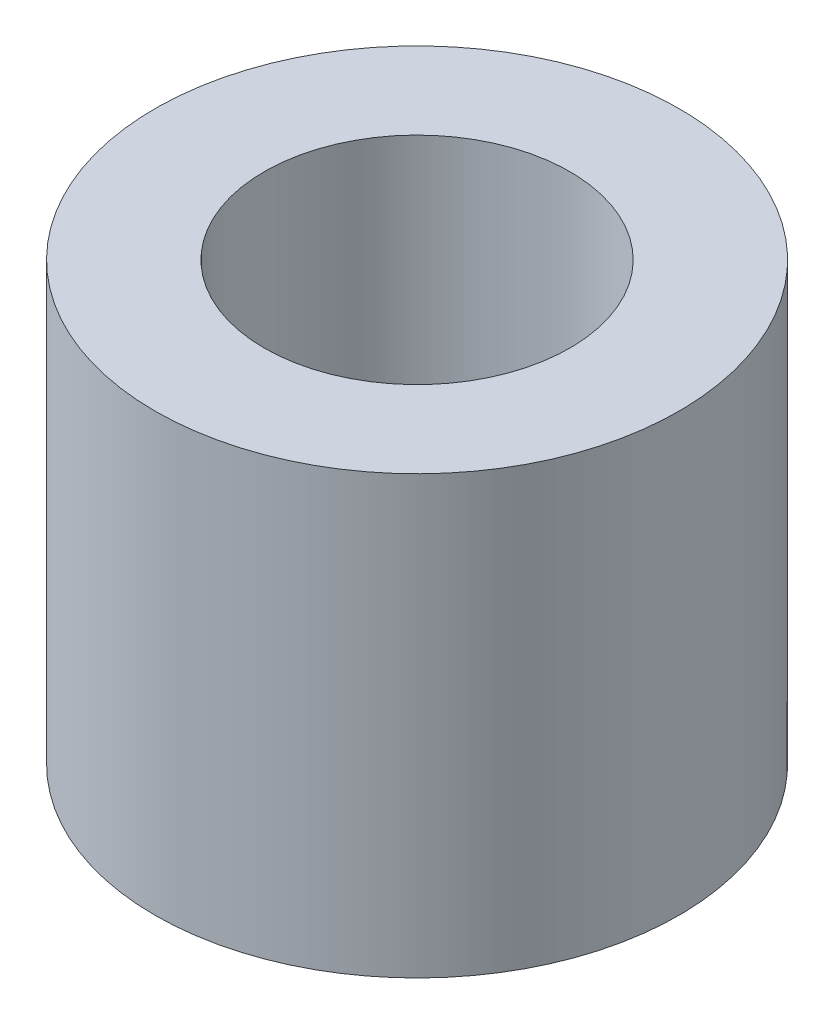
ISO-10303-21;
HEADER;
FILE_DESCRIPTION(('STEP AP214'),'2;1');
FILE_NAME('part.step','',(''),(''),'','','');
FILE_SCHEMA(('AUTOMOTIVE_DESIGN { 1 0 10303 214 1 1 1 1 }'));
ENDSEC;
DATA;
#1=APPLICATION_CONTEXT('core data for automotive mechanical design processes');
#2=APPLICATION_PROTOCOL_DEFINITION('international standard','automotive_design',2000,#1);
#3=PRODUCT_CONTEXT('',#1,'mechanical');
#4=PRODUCT('Part','Part','',(#3));
#5=PRODUCT_RELATED_PRODUCT_CATEGORY('part','',(#4));
#6=PRODUCT_DEFINITION_FORMATION('','',#4);
#7=PRODUCT_DEFINITION_CONTEXT('part definition',#1,'design');
#8=PRODUCT_DEFINITION('design','',#6,#7);
#9=PRODUCT_DEFINITION_SHAPE('','',#8);
#10=(LENGTH_UNIT() NAMED_UNIT(*) SI_UNIT(.MILLI.,.METRE.));
#11=(NAMED_UNIT(*) PLANE_ANGLE_UNIT() SI_UNIT($,.RADIAN.));
#12=(NAMED_UNIT(*) SI_UNIT($,.STERADIAN.) SOLID_ANGLE_UNIT());
#13=UNCERTAINTY_MEASURE_WITH_UNIT(LENGTH_MEASURE(1.E-05),#10,'distance_accuracy_value','');
#14=(GEOMETRIC_REPRESENTATION_CONTEXT(3) GLOBAL_UNCERTAINTY_ASSIGNED_CONTEXT((#13)) GLOBAL_UNIT_ASSIGNED_CONTEXT((#10,
#11,#12)) REPRESENTATION_CONTEXT('',''));
#15=CARTESIAN_POINT('',(0.,0.,0.));
#16=DIRECTION('',(0.,0.,1.));
#17=DIRECTION('',(1.,0.,0.));
#18=AXIS2_PLACEMENT_3D('',#15,#16,#17);
#19=CARTESIAN_POINT('',(0.,10.,0.));
#20=DIRECTION('',(0.,1.,0.));
#21=DIRECTION('',(0.,0.,1.));
#22=AXIS2_PLACEMENT_3D('',#19,#20,#21);
#23=PLANE('',#22);
#24=CARTESIAN_POINT('',(0.,10.,0.));
#25=DIRECTION('',(0.,1.,0.));
#26=DIRECTION('',(0.,0.,1.));
#27=AXIS2_PLACEMENT_3D('',#24,#25,#26);
#28=CIRCLE('',#27,3.);
#29=CARTESIAN_POINT('',(0.,10.,3.));
#30=VERTEX_POINT('',#29);
#31=EDGE_CURVE('E11',#30,#30,#28,.T.);
#32=ORIENTED_EDGE('',*,*,#31,.T.);
#33=EDGE_LOOP('',(#32));
#34=FACE_BOUND('',#33,.T.);
#35=CARTESIAN_POINT('',(0.,10.,0.));
#36=DIRECTION('',(0.,1.,0.));
#37=DIRECTION('',(0.,0.,1.));
#38=AXIS2_PLACEMENT_3D('',#35,#36,#37);
#39=CIRCLE('',#38,1.75);
#40=CARTESIAN_POINT('',(0.,10.,1.75));
#41=VERTEX_POINT('',#40);
#42=EDGE_CURVE('E58',#41,#41,#39,.T.);
#43=ORIENTED_EDGE('',*,*,#42,.F.);
#44=EDGE_LOOP('',(#43));
#45=FACE_BOUND('',#44,.T.);
#46=ADVANCED_FACE('F43',(#34,#45),#23,.T.);
#47=CARTESIAN_POINT('',(0.,5.,0.));
#48=DIRECTION('',(0.,1.,0.));
#49=DIRECTION('',(0.,0.,1.));
#50=AXIS2_PLACEMENT_3D('',#47,#48,#49);
#51=PLANE('',#50);
#52=CARTESIAN_POINT('',(0.,5.,0.));
#53=DIRECTION('',(0.,1.,0.));
#54=DIRECTION('',(0.,0.,1.));
#55=AXIS2_PLACEMENT_3D('',#52,#53,#54);
#56=CIRCLE('',#55,3.);
#57=CARTESIAN_POINT('',(0.,5.,3.));
#58=VERTEX_POINT('',#57);
#59=EDGE_CURVE('E52',#58,#58,#56,.T.);
#60=ORIENTED_EDGE('',*,*,#59,.F.);
#61=EDGE_LOOP('',(#60));
#62=FACE_BOUND('',#61,.T.);
#63=CARTESIAN_POINT('',(0.,5.,0.));
#64=DIRECTION('',(0.,1.,0.));
#65=DIRECTION('',(0.,0.,1.));
#66=AXIS2_PLACEMENT_3D('',#63,#64,#65);
#67=CIRCLE('',#66,1.75);
#68=CARTESIAN_POINT('',(0.,5.,1.75));
#69=VERTEX_POINT('',#68);
#70=EDGE_CURVE('E47',#69,#69,#67,.T.);
#71=ORIENTED_EDGE('',*,*,#70,.T.);
#72=EDGE_LOOP('',(#71));
#73=FACE_BOUND('',#72,.T.);
#74=ADVANCED_FACE('F45',(#62,#73),#51,.F.);
#75=CARTESIAN_POINT('',(0.,10.,0.));
#76=DIRECTION('',(0.,-1.,0.));
#77=DIRECTION('',(0.,0.,-1.));
#78=AXIS2_PLACEMENT_3D('',#75,#76,#77);
#79=CYLINDRICAL_SURFACE('',#78,3.);
#80=ORIENTED_EDGE('',*,*,#31,.F.);
#81=EDGE_LOOP('',(#80));
#82=FACE_BOUND('',#81,.T.);
#83=ORIENTED_EDGE('',*,*,#59,.T.);
#84=EDGE_LOOP('',(#83));
#85=FACE_BOUND('',#84,.T.);
#86=ADVANCED_FACE('F71',(#82,#85),#79,.T.);
#87=CARTESIAN_POINT('',(0.,10.,0.));
#88=DIRECTION('',(0.,-1.,0.));
#89=DIRECTION('',(0.,0.,-1.));
#90=AXIS2_PLACEMENT_3D('',#87,#88,#89);
#91=CYLINDRICAL_SURFACE('',#90,1.75);
#92=ORIENTED_EDGE('',*,*,#42,.T.);
#93=EDGE_LOOP('',(#92));
#94=FACE_BOUND('',#93,.T.);
#95=ORIENTED_EDGE('',*,*,#70,.F.);
#96=EDGE_LOOP('',(#95));
#97=FACE_BOUND('',#96,.T.);
#98=ADVANCED_FACE('F69',(#94,#97),#91,.F.);
#99=CLOSED_SHELL('',(#46,#74,#86,#98));
#100=MANIFOLD_SOLID_BREP('B2',#99);
#101=ADVANCED_BREP_SHAPE_REPRESENTATION('',(#18,#100),#14);
#102=SHAPE_DEFINITION_REPRESENTATION(#9,#101);
ENDSEC;
END-ISO-10303-21;
